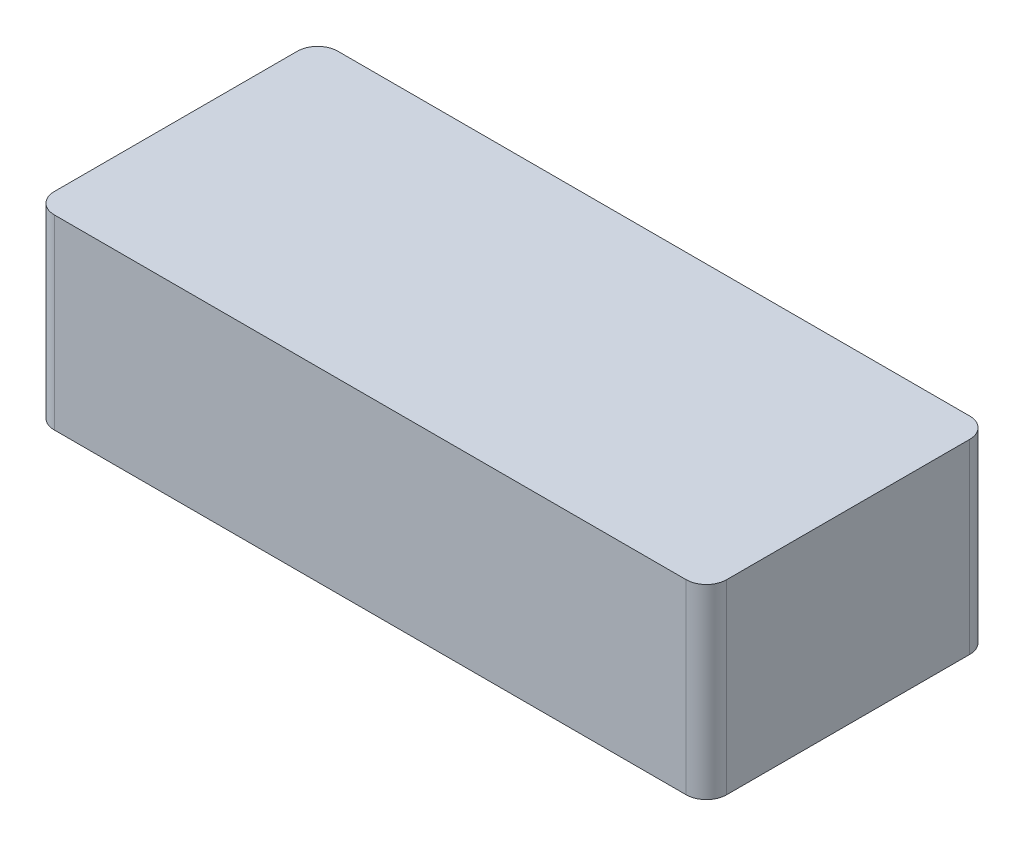
ISO-10303-21;
HEADER;
FILE_DESCRIPTION(('STEP AP214'),'2;1');
FILE_NAME('part.step','',(''),(''),'','','');
FILE_SCHEMA(('AUTOMOTIVE_DESIGN { 1 0 10303 214 1 1 1 1 }'));
ENDSEC;
DATA;
#1=APPLICATION_CONTEXT('core data for automotive mechanical design processes');
#2=APPLICATION_PROTOCOL_DEFINITION('international standard','automotive_design',2000,#1);
#3=PRODUCT_CONTEXT('',#1,'mechanical');
#4=PRODUCT('Part','Part','',(#3));
#5=PRODUCT_RELATED_PRODUCT_CATEGORY('part','',(#4));
#6=PRODUCT_DEFINITION_FORMATION('','',#4);
#7=PRODUCT_DEFINITION_CONTEXT('part definition',#1,'design');
#8=PRODUCT_DEFINITION('design','',#6,#7);
#9=PRODUCT_DEFINITION_SHAPE('','',#8);
#10=(LENGTH_UNIT() NAMED_UNIT(*) SI_UNIT(.MILLI.,.METRE.));
#11=(NAMED_UNIT(*) PLANE_ANGLE_UNIT() SI_UNIT($,.RADIAN.));
#12=(NAMED_UNIT(*) SI_UNIT($,.STERADIAN.) SOLID_ANGLE_UNIT());
#13=UNCERTAINTY_MEASURE_WITH_UNIT(LENGTH_MEASURE(1.E-05),#10,'distance_accuracy_value','');
#14=(GEOMETRIC_REPRESENTATION_CONTEXT(3) GLOBAL_UNCERTAINTY_ASSIGNED_CONTEXT((#13)) GLOBAL_UNIT_ASSIGNED_CONTEXT((#10,
#11,#12)) REPRESENTATION_CONTEXT('',''));
#15=CARTESIAN_POINT('',(0.,0.,0.));
#16=DIRECTION('',(0.,0.,1.));
#17=DIRECTION('',(1.,0.,0.));
#18=AXIS2_PLACEMENT_3D('',#15,#16,#17);
#19=CARTESIAN_POINT('',(0.,2.,0.));
#20=DIRECTION('',(0.,-1.,0.));
#21=DIRECTION('',(0.,0.,-1.));
#22=AXIS2_PLACEMENT_3D('',#19,#20,#21);
#23=PLANE('',#22);
#24=CARTESIAN_POINT('',(62.6371308016877,2.,-42.8481012658228));
#25=DIRECTION('',(0.,-1.,0.));
#26=DIRECTION('',(0.,0.,-1.));
#27=AXIS2_PLACEMENT_3D('',#24,#25,#26);
#28=CIRCLE('',#27,5.);
#29=CARTESIAN_POINT('',(67.6371308016878,2.,-42.8481012658228));
#30=VERTEX_POINT('',#29);
#31=CARTESIAN_POINT('',(62.6371308016877,2.,-47.8481012658228));
#32=VERTEX_POINT('',#31);
#33=EDGE_CURVE('E188',#30,#32,#28,.F.);
#34=ORIENTED_EDGE('',*,*,#33,.F.);
#35=DIRECTION('',(0.,0.,1.));
#36=VECTOR('',#35,1.);
#37=CARTESIAN_POINT('',(67.6371308016878,2.,-47.8481012658228));
#38=LINE('',#37,#36);
#39=CARTESIAN_POINT('',(67.6371308016878,2.,17.1518987341772));
#40=VERTEX_POINT('',#39);
#41=EDGE_CURVE('E182',#30,#40,#38,.T.);
#42=ORIENTED_EDGE('',*,*,#41,.T.);
#43=CARTESIAN_POINT('',(62.6371308016878,2.,17.1518987341772));
#44=DIRECTION('',(0.,-1.,0.));
#45=DIRECTION('',(0.,0.,-1.));
#46=AXIS2_PLACEMENT_3D('',#43,#44,#45);
#47=CIRCLE('',#46,5.);
#48=CARTESIAN_POINT('',(62.6371308016878,2.,22.1518987341772));
#49=VERTEX_POINT('',#48);
#50=EDGE_CURVE('E190',#49,#40,#47,.F.);
#51=ORIENTED_EDGE('',*,*,#50,.F.);
#52=DIRECTION('',(-1.,0.,0.));
#53=VECTOR('',#52,1.);
#54=CARTESIAN_POINT('',(-98.3544303797468,2.,22.1518987341772));
#55=LINE('',#54,#53);
#56=CARTESIAN_POINT('',(-93.3544303797468,2.,22.1518987341772));
#57=VERTEX_POINT('',#56);
#58=EDGE_CURVE('E186',#49,#57,#55,.T.);
#59=ORIENTED_EDGE('',*,*,#58,.T.);
#60=CARTESIAN_POINT('',(-93.3544303797468,2.,17.1518987341772));
#61=DIRECTION('',(0.,-1.,0.));
#62=DIRECTION('',(0.,0.,-1.));
#63=AXIS2_PLACEMENT_3D('',#60,#61,#62);
#64=CIRCLE('',#63,5.);
#65=CARTESIAN_POINT('',(-98.3544303797468,2.,17.1518987341772));
#66=VERTEX_POINT('',#65);
#67=EDGE_CURVE('E38',#66,#57,#64,.F.);
#68=ORIENTED_EDGE('',*,*,#67,.F.);
#69=DIRECTION('',(0.,0.,-1.));
#70=VECTOR('',#69,1.);
#71=CARTESIAN_POINT('',(-98.3544303797468,2.,-47.8481012658228));
#72=LINE('',#71,#70);
#73=CARTESIAN_POINT('',(-98.3544303797468,2.,-42.8481012658228));
#74=VERTEX_POINT('',#73);
#75=EDGE_CURVE('E143',#66,#74,#72,.T.);
#76=ORIENTED_EDGE('',*,*,#75,.T.);
#77=CARTESIAN_POINT('',(-93.3544303797468,2.,-42.8481012658228));
#78=DIRECTION('',(0.,-1.,0.));
#79=DIRECTION('',(0.,0.,-1.));
#80=AXIS2_PLACEMENT_3D('',#77,#78,#79);
#81=CIRCLE('',#80,5.);
#82=CARTESIAN_POINT('',(-93.3544303797468,2.,-47.8481012658228));
#83=VERTEX_POINT('',#82);
#84=EDGE_CURVE('E132',#83,#74,#81,.F.);
#85=ORIENTED_EDGE('',*,*,#84,.F.);
#86=DIRECTION('',(1.,0.,0.));
#87=VECTOR('',#86,1.);
#88=CARTESIAN_POINT('',(-98.3544303797468,2.,-47.8481012658228));
#89=LINE('',#88,#87);
#90=EDGE_CURVE('E178',#83,#32,#89,.T.);
#91=ORIENTED_EDGE('',*,*,#90,.T.);
#92=EDGE_LOOP('',(#34,#42,#51,#59,#68,#76,#85,#91));
#93=FACE_BOUND('',#92,.T.);
#94=ADVANCED_FACE('F34',(#93),#23,.T.);
#95=CARTESIAN_POINT('',(0.,48.,0.));
#96=DIRECTION('',(0.,1.,0.));
#97=DIRECTION('',(0.,0.,1.));
#98=AXIS2_PLACEMENT_3D('',#95,#96,#97);
#99=PLANE('',#98);
#100=CARTESIAN_POINT('',(62.6371308016877,48.,-42.8481012658228));
#101=DIRECTION('',(0.,1.,0.));
#102=DIRECTION('',(0.,0.,1.));
#103=AXIS2_PLACEMENT_3D('',#100,#101,#102);
#104=CIRCLE('',#103,5.);
#105=CARTESIAN_POINT('',(62.6371308016877,48.,-47.8481012658228));
#106=VERTEX_POINT('',#105);
#107=CARTESIAN_POINT('',(67.6371308016878,48.,-42.8481012658228));
#108=VERTEX_POINT('',#107);
#109=EDGE_CURVE('E189',#106,#108,#104,.F.);
#110=ORIENTED_EDGE('',*,*,#109,.F.);
#111=DIRECTION('',(-1.,0.,0.));
#112=VECTOR('',#111,1.);
#113=CARTESIAN_POINT('',(-98.3544303797468,48.,-47.8481012658228));
#114=LINE('',#113,#112);
#115=CARTESIAN_POINT('',(-93.3544303797468,48.,-47.8481012658228));
#116=VERTEX_POINT('',#115);
#117=EDGE_CURVE('E181',#106,#116,#114,.T.);
#118=ORIENTED_EDGE('',*,*,#117,.T.);
#119=CARTESIAN_POINT('',(-93.3544303797468,48.,-42.8481012658228));
#120=DIRECTION('',(0.,1.,0.));
#121=DIRECTION('',(0.,0.,1.));
#122=AXIS2_PLACEMENT_3D('',#119,#120,#121);
#123=CIRCLE('',#122,5.);
#124=CARTESIAN_POINT('',(-98.3544303797468,48.,-42.8481012658228));
#125=VERTEX_POINT('',#124);
#126=EDGE_CURVE('E142',#125,#116,#123,.F.);
#127=ORIENTED_EDGE('',*,*,#126,.F.);
#128=DIRECTION('',(0.,0.,1.));
#129=VECTOR('',#128,1.);
#130=CARTESIAN_POINT('',(-98.3544303797468,48.,-47.8481012658228));
#131=LINE('',#130,#129);
#132=CARTESIAN_POINT('',(-98.3544303797468,48.,17.1518987341772));
#133=VERTEX_POINT('',#132);
#134=EDGE_CURVE('E150',#125,#133,#131,.T.);
#135=ORIENTED_EDGE('',*,*,#134,.T.);
#136=CARTESIAN_POINT('',(-93.3544303797468,48.,17.1518987341772));
#137=DIRECTION('',(0.,1.,0.));
#138=DIRECTION('',(0.,0.,1.));
#139=AXIS2_PLACEMENT_3D('',#136,#137,#138);
#140=CIRCLE('',#139,5.);
#141=CARTESIAN_POINT('',(-93.3544303797468,48.,22.1518987341772));
#142=VERTEX_POINT('',#141);
#143=EDGE_CURVE('E177',#142,#133,#140,.F.);
#144=ORIENTED_EDGE('',*,*,#143,.F.);
#145=DIRECTION('',(1.,0.,0.));
#146=VECTOR('',#145,1.);
#147=CARTESIAN_POINT('',(-98.3544303797468,48.,22.1518987341772));
#148=LINE('',#147,#146);
#149=CARTESIAN_POINT('',(62.6371308016878,48.,22.1518987341772));
#150=VERTEX_POINT('',#149);
#151=EDGE_CURVE('E185',#142,#150,#148,.T.);
#152=ORIENTED_EDGE('',*,*,#151,.T.);
#153=CARTESIAN_POINT('',(62.6371308016878,48.,17.1518987341772));
#154=DIRECTION('',(0.,1.,0.));
#155=DIRECTION('',(0.,0.,1.));
#156=AXIS2_PLACEMENT_3D('',#153,#154,#155);
#157=CIRCLE('',#156,5.);
#158=CARTESIAN_POINT('',(67.6371308016878,48.,17.1518987341772));
#159=VERTEX_POINT('',#158);
#160=EDGE_CURVE('E191',#159,#150,#157,.F.);
#161=ORIENTED_EDGE('',*,*,#160,.F.);
#162=DIRECTION('',(0.,0.,-1.));
#163=VECTOR('',#162,1.);
#164=CARTESIAN_POINT('',(67.6371308016878,48.,-47.8481012658228));
#165=LINE('',#164,#163);
#166=EDGE_CURVE('E180',#159,#108,#165,.T.);
#167=ORIENTED_EDGE('',*,*,#166,.T.);
#168=EDGE_LOOP('',(#110,#118,#127,#135,#144,#152,#161,#167));
#169=FACE_BOUND('',#168,.T.);
#170=ADVANCED_FACE('F210',(#169),#99,.T.);
#171=CARTESIAN_POINT('',(-98.3544303797468,50.,-47.8481012658228));
#172=DIRECTION('',(0.,0.,1.));
#173=DIRECTION('',(1.,0.,0.));
#174=AXIS2_PLACEMENT_3D('',#171,#172,#173);
#175=PLANE('',#174);
#176=ORIENTED_EDGE('',*,*,#90,.F.);
#177=DIRECTION('',(0.,-1.,0.));
#178=VECTOR('',#177,1.);
#179=CARTESIAN_POINT('',(-93.3544303797468,50.,-47.8481012658228));
#180=LINE('',#179,#178);
#181=EDGE_CURVE('E138',#83,#116,#180,.F.);
#182=ORIENTED_EDGE('',*,*,#181,.T.);
#183=ORIENTED_EDGE('',*,*,#117,.F.);
#184=DIRECTION('',(0.,-1.,0.));
#185=VECTOR('',#184,1.);
#186=CARTESIAN_POINT('',(62.6371308016877,50.,-47.8481012658228));
#187=LINE('',#186,#185);
#188=EDGE_CURVE('E156',#106,#32,#187,.T.);
#189=ORIENTED_EDGE('',*,*,#188,.T.);
#190=EDGE_LOOP('',(#176,#182,#183,#189));
#191=FACE_BOUND('',#190,.T.);
#192=ADVANCED_FACE('F212',(#191),#175,.F.);
#193=CARTESIAN_POINT('',(67.6371308016878,50.,-47.8481012658228));
#194=DIRECTION('',(-1.,0.,0.));
#195=DIRECTION('',(0.,0.,1.));
#196=AXIS2_PLACEMENT_3D('',#193,#194,#195);
#197=PLANE('',#196);
#198=ORIENTED_EDGE('',*,*,#41,.F.);
#199=DIRECTION('',(0.,-1.,0.));
#200=VECTOR('',#199,1.);
#201=CARTESIAN_POINT('',(67.6371308016878,50.,-42.8481012658228));
#202=LINE('',#201,#200);
#203=EDGE_CURVE('E168',#30,#108,#202,.F.);
#204=ORIENTED_EDGE('',*,*,#203,.T.);
#205=ORIENTED_EDGE('',*,*,#166,.F.);
#206=DIRECTION('',(0.,-1.,0.));
#207=VECTOR('',#206,1.);
#208=CARTESIAN_POINT('',(67.6371308016878,50.,17.1518987341772));
#209=LINE('',#208,#207);
#210=EDGE_CURVE('E165',#159,#40,#209,.T.);
#211=ORIENTED_EDGE('',*,*,#210,.T.);
#212=EDGE_LOOP('',(#198,#204,#205,#211));
#213=FACE_BOUND('',#212,.T.);
#214=ADVANCED_FACE('F215',(#213),#197,.F.);
#215=CARTESIAN_POINT('',(-98.3544303797468,50.,22.1518987341772));
#216=DIRECTION('',(0.,0.,-1.));
#217=DIRECTION('',(-1.,0.,0.));
#218=AXIS2_PLACEMENT_3D('',#215,#216,#217);
#219=PLANE('',#218);
#220=ORIENTED_EDGE('',*,*,#58,.F.);
#221=DIRECTION('',(0.,-1.,0.));
#222=VECTOR('',#221,1.);
#223=CARTESIAN_POINT('',(62.6371308016878,50.,22.1518987341772));
#224=LINE('',#223,#222);
#225=EDGE_CURVE('E174',#49,#150,#224,.F.);
#226=ORIENTED_EDGE('',*,*,#225,.T.);
#227=ORIENTED_EDGE('',*,*,#151,.F.);
#228=DIRECTION('',(0.,-1.,0.));
#229=VECTOR('',#228,1.);
#230=CARTESIAN_POINT('',(-93.3544303797468,50.,22.1518987341772));
#231=LINE('',#230,#229);
#232=EDGE_CURVE('E171',#142,#57,#231,.T.);
#233=ORIENTED_EDGE('',*,*,#232,.T.);
#234=EDGE_LOOP('',(#220,#226,#227,#233));
#235=FACE_BOUND('',#234,.T.);
#236=ADVANCED_FACE('F232',(#235),#219,.F.);
#237=CARTESIAN_POINT('',(-98.3544303797468,50.,-47.8481012658228));
#238=DIRECTION('',(1.,0.,0.));
#239=DIRECTION('',(0.,0.,-1.));
#240=AXIS2_PLACEMENT_3D('',#237,#238,#239);
#241=PLANE('',#240);
#242=ORIENTED_EDGE('',*,*,#75,.F.);
#243=DIRECTION('',(0.,-1.,0.));
#244=VECTOR('',#243,1.);
#245=CARTESIAN_POINT('',(-98.3544303797468,50.,17.1518987341772));
#246=LINE('',#245,#244);
#247=EDGE_CURVE('E155',#66,#133,#246,.F.);
#248=ORIENTED_EDGE('',*,*,#247,.T.);
#249=ORIENTED_EDGE('',*,*,#134,.F.);
#250=DIRECTION('',(0.,-1.,0.));
#251=VECTOR('',#250,1.);
#252=CARTESIAN_POINT('',(-98.3544303797468,50.,-42.8481012658228));
#253=LINE('',#252,#251);
#254=EDGE_CURVE('E136',#125,#74,#253,.T.);
#255=ORIENTED_EDGE('',*,*,#254,.T.);
#256=EDGE_LOOP('',(#242,#248,#249,#255));
#257=FACE_BOUND('',#256,.T.);
#258=ADVANCED_FACE('F153',(#257),#241,.F.);
#259=CARTESIAN_POINT('',(-93.3544303797468,50.,17.1518987341772));
#260=DIRECTION('',(0.,-1.,0.));
#261=DIRECTION('',(0.,0.,-1.));
#262=AXIS2_PLACEMENT_3D('',#259,#260,#261);
#263=CYLINDRICAL_SURFACE('',#262,5.);
#264=ORIENTED_EDGE('',*,*,#247,.F.);
#265=ORIENTED_EDGE('',*,*,#67,.T.);
#266=ORIENTED_EDGE('',*,*,#232,.F.);
#267=ORIENTED_EDGE('',*,*,#143,.T.);
#268=EDGE_LOOP('',(#264,#265,#266,#267));
#269=FACE_BOUND('',#268,.T.);
#270=ADVANCED_FACE('F36',(#269),#263,.T.);
#271=CARTESIAN_POINT('',(62.6371308016878,50.,17.1518987341772));
#272=DIRECTION('',(0.,-1.,0.));
#273=DIRECTION('',(0.,0.,-1.));
#274=AXIS2_PLACEMENT_3D('',#271,#272,#273);
#275=CYLINDRICAL_SURFACE('',#274,5.);
#276=ORIENTED_EDGE('',*,*,#225,.F.);
#277=ORIENTED_EDGE('',*,*,#50,.T.);
#278=ORIENTED_EDGE('',*,*,#210,.F.);
#279=ORIENTED_EDGE('',*,*,#160,.T.);
#280=EDGE_LOOP('',(#276,#277,#278,#279));
#281=FACE_BOUND('',#280,.T.);
#282=ADVANCED_FACE('F219',(#281),#275,.T.);
#283=CARTESIAN_POINT('',(62.6371308016877,50.,-42.8481012658228));
#284=DIRECTION('',(0.,-1.,0.));
#285=DIRECTION('',(0.,0.,-1.));
#286=AXIS2_PLACEMENT_3D('',#283,#284,#285);
#287=CYLINDRICAL_SURFACE('',#286,5.);
#288=ORIENTED_EDGE('',*,*,#203,.F.);
#289=ORIENTED_EDGE('',*,*,#33,.T.);
#290=ORIENTED_EDGE('',*,*,#188,.F.);
#291=ORIENTED_EDGE('',*,*,#109,.T.);
#292=EDGE_LOOP('',(#288,#289,#290,#291));
#293=FACE_BOUND('',#292,.T.);
#294=ADVANCED_FACE('F217',(#293),#287,.T.);
#295=CARTESIAN_POINT('',(-93.3544303797468,50.,-42.8481012658228));
#296=DIRECTION('',(0.,-1.,0.));
#297=DIRECTION('',(0.,0.,-1.));
#298=AXIS2_PLACEMENT_3D('',#295,#296,#297);
#299=CYLINDRICAL_SURFACE('',#298,5.);
#300=ORIENTED_EDGE('',*,*,#181,.F.);
#301=ORIENTED_EDGE('',*,*,#84,.T.);
#302=ORIENTED_EDGE('',*,*,#254,.F.);
#303=ORIENTED_EDGE('',*,*,#126,.T.);
#304=EDGE_LOOP('',(#300,#301,#302,#303));
#305=FACE_BOUND('',#304,.T.);
#306=ADVANCED_FACE('F134',(#305),#299,.T.);
#307=CLOSED_SHELL('',(#94,#170,#192,#214,#236,#258,#270,#282,#294,#306));
#308=CARTESIAN_POINT('',(-95.3544303797468,47.,-47.8481012658228));
#309=DIRECTION('',(1.,0.,0.));
#310=DIRECTION('',(0.,0.,-1.));
#311=AXIS2_PLACEMENT_3D('',#308,#309,#310);
#312=PLANE('',#311);
#313=DIRECTION('',(0.,0.,1.));
#314=VECTOR('',#313,1.);
#315=CARTESIAN_POINT('',(-95.3544303797468,3.,-47.8481012658228));
#316=LINE('',#315,#314);
#317=CARTESIAN_POINT('',(-95.3544303797468,3.,-44.8481012658228));
#318=VERTEX_POINT('',#317);
#319=CARTESIAN_POINT('',(-95.3544303797468,3.,19.1518987341772));
#320=VERTEX_POINT('',#319);
#321=EDGE_CURVE('E11',#318,#320,#316,.T.);
#322=ORIENTED_EDGE('',*,*,#321,.F.);
#323=DIRECTION('',(0.,-1.,0.));
#324=VECTOR('',#323,1.);
#325=CARTESIAN_POINT('',(-95.3544303797468,47.,-44.8481012658228));
#326=LINE('',#325,#324);
#327=CARTESIAN_POINT('',(-95.3544303797468,47.,-44.8481012658228));
#328=VERTEX_POINT('',#327);
#329=EDGE_CURVE('E268',#328,#318,#326,.T.);
#330=ORIENTED_EDGE('',*,*,#329,.F.);
#331=DIRECTION('',(0.,0.,1.));
#332=VECTOR('',#331,1.);
#333=CARTESIAN_POINT('',(-95.3544303797468,47.,-47.8481012658228));
#334=LINE('',#333,#332);
#335=CARTESIAN_POINT('',(-95.3544303797468,47.,19.1518987341772));
#336=VERTEX_POINT('',#335);
#337=EDGE_CURVE('E278',#328,#336,#334,.T.);
#338=ORIENTED_EDGE('',*,*,#337,.T.);
#339=DIRECTION('',(0.,-1.,0.));
#340=VECTOR('',#339,1.);
#341=CARTESIAN_POINT('',(-95.3544303797468,47.,19.1518987341772));
#342=LINE('',#341,#340);
#343=EDGE_CURVE('E158',#336,#320,#342,.T.);
#344=ORIENTED_EDGE('',*,*,#343,.T.);
#345=EDGE_LOOP('',(#322,#330,#338,#344));
#346=FACE_BOUND('',#345,.T.);
#347=ADVANCED_FACE('F261',(#346),#312,.T.);
#348=CARTESIAN_POINT('',(-98.3544303797468,47.,19.1518987341772));
#349=DIRECTION('',(0.,0.,-1.));
#350=DIRECTION('',(-1.,0.,0.));
#351=AXIS2_PLACEMENT_3D('',#348,#349,#350);
#352=PLANE('',#351);
#353=DIRECTION('',(1.,0.,0.));
#354=VECTOR('',#353,1.);
#355=CARTESIAN_POINT('',(-98.3544303797468,3.,19.1518987341772));
#356=LINE('',#355,#354);
#357=CARTESIAN_POINT('',(64.6371308016878,3.,19.1518987341772));
#358=VERTEX_POINT('',#357);
#359=EDGE_CURVE('E45',#320,#358,#356,.T.);
#360=ORIENTED_EDGE('',*,*,#359,.F.);
#361=ORIENTED_EDGE('',*,*,#343,.F.);
#362=DIRECTION('',(1.,0.,0.));
#363=VECTOR('',#362,1.);
#364=CARTESIAN_POINT('',(-98.3544303797468,47.,19.1518987341772));
#365=LINE('',#364,#363);
#366=CARTESIAN_POINT('',(64.6371308016878,47.,19.1518987341772));
#367=VERTEX_POINT('',#366);
#368=EDGE_CURVE('E68',#336,#367,#365,.T.);
#369=ORIENTED_EDGE('',*,*,#368,.T.);
#370=DIRECTION('',(0.,-1.,0.));
#371=VECTOR('',#370,1.);
#372=CARTESIAN_POINT('',(64.6371308016878,47.,19.1518987341772));
#373=LINE('',#372,#371);
#374=EDGE_CURVE('E273',#367,#358,#373,.T.);
#375=ORIENTED_EDGE('',*,*,#374,.T.);
#376=EDGE_LOOP('',(#360,#361,#369,#375));
#377=FACE_BOUND('',#376,.T.);
#378=ADVANCED_FACE('F257',(#377),#352,.T.);
#379=CARTESIAN_POINT('',(64.6371308016878,47.,-47.8481012658228));
#380=DIRECTION('',(-1.,0.,0.));
#381=DIRECTION('',(0.,0.,1.));
#382=AXIS2_PLACEMENT_3D('',#379,#380,#381);
#383=PLANE('',#382);
#384=DIRECTION('',(0.,0.,-1.));
#385=VECTOR('',#384,1.);
#386=CARTESIAN_POINT('',(64.6371308016878,3.,-47.8481012658228));
#387=LINE('',#386,#385);
#388=CARTESIAN_POINT('',(64.6371308016878,3.,-44.8481012658228));
#389=VERTEX_POINT('',#388);
#390=EDGE_CURVE('E270',#358,#389,#387,.T.);
#391=ORIENTED_EDGE('',*,*,#390,.F.);
#392=ORIENTED_EDGE('',*,*,#374,.F.);
#393=DIRECTION('',(0.,0.,-1.));
#394=VECTOR('',#393,1.);
#395=CARTESIAN_POINT('',(64.6371308016878,47.,-47.8481012658228));
#396=LINE('',#395,#394);
#397=CARTESIAN_POINT('',(64.6371308016878,47.,-44.8481012658228));
#398=VERTEX_POINT('',#397);
#399=EDGE_CURVE('E284',#367,#398,#396,.T.);
#400=ORIENTED_EDGE('',*,*,#399,.T.);
#401=DIRECTION('',(0.,-1.,0.));
#402=VECTOR('',#401,1.);
#403=CARTESIAN_POINT('',(64.6371308016878,47.,-44.8481012658228));
#404=LINE('',#403,#402);
#405=EDGE_CURVE('E274',#398,#389,#404,.T.);
#406=ORIENTED_EDGE('',*,*,#405,.T.);
#407=EDGE_LOOP('',(#391,#392,#400,#406));
#408=FACE_BOUND('',#407,.T.);
#409=ADVANCED_FACE('F253',(#408),#383,.T.);
#410=CARTESIAN_POINT('',(-98.3544303797468,47.,-44.8481012658228));
#411=DIRECTION('',(0.,0.,1.));
#412=DIRECTION('',(1.,0.,0.));
#413=AXIS2_PLACEMENT_3D('',#410,#411,#412);
#414=PLANE('',#413);
#415=DIRECTION('',(-1.,0.,0.));
#416=VECTOR('',#415,1.);
#417=CARTESIAN_POINT('',(-98.3544303797468,3.,-44.8481012658228));
#418=LINE('',#417,#416);
#419=EDGE_CURVE('E80',#389,#318,#418,.T.);
#420=ORIENTED_EDGE('',*,*,#419,.F.);
#421=ORIENTED_EDGE('',*,*,#405,.F.);
#422=DIRECTION('',(-1.,0.,0.));
#423=VECTOR('',#422,1.);
#424=CARTESIAN_POINT('',(-98.3544303797468,47.,-44.8481012658228));
#425=LINE('',#424,#423);
#426=EDGE_CURVE('E282',#398,#328,#425,.T.);
#427=ORIENTED_EDGE('',*,*,#426,.T.);
#428=ORIENTED_EDGE('',*,*,#329,.T.);
#429=EDGE_LOOP('',(#420,#421,#427,#428));
#430=FACE_BOUND('',#429,.T.);
#431=ADVANCED_FACE('F247',(#430),#414,.T.);
#432=CARTESIAN_POINT('',(0.,47.,0.));
#433=DIRECTION('',(0.,1.,0.));
#434=DIRECTION('',(0.,0.,1.));
#435=AXIS2_PLACEMENT_3D('',#432,#433,#434);
#436=PLANE('',#435);
#437=ORIENTED_EDGE('',*,*,#337,.F.);
#438=ORIENTED_EDGE('',*,*,#426,.F.);
#439=ORIENTED_EDGE('',*,*,#399,.F.);
#440=ORIENTED_EDGE('',*,*,#368,.F.);
#441=EDGE_LOOP('',(#437,#438,#439,#440));
#442=FACE_BOUND('',#441,.T.);
#443=ADVANCED_FACE('F243',(#442),#436,.F.);
#444=CARTESIAN_POINT('',(0.,3.,0.));
#445=DIRECTION('',(0.,1.,0.));
#446=DIRECTION('',(0.,0.,1.));
#447=AXIS2_PLACEMENT_3D('',#444,#445,#446);
#448=PLANE('',#447);
#449=ORIENTED_EDGE('',*,*,#321,.T.);
#450=ORIENTED_EDGE('',*,*,#359,.T.);
#451=ORIENTED_EDGE('',*,*,#390,.T.);
#452=ORIENTED_EDGE('',*,*,#419,.T.);
#453=EDGE_LOOP('',(#449,#450,#451,#452));
#454=FACE_BOUND('',#453,.T.);
#455=ADVANCED_FACE('F246',(#454),#448,.T.);
#456=CLOSED_SHELL('',(#347,#378,#409,#431,#443,#455));
#457=ORIENTED_CLOSED_SHELL('',*,#456,.T.);
#458=BREP_WITH_VOIDS('B2',#307,(#457));
#459=ADVANCED_BREP_SHAPE_REPRESENTATION('',(#18,#458),#14);
#460=SHAPE_DEFINITION_REPRESENTATION(#9,#459);
ENDSEC;
END-ISO-10303-21;
